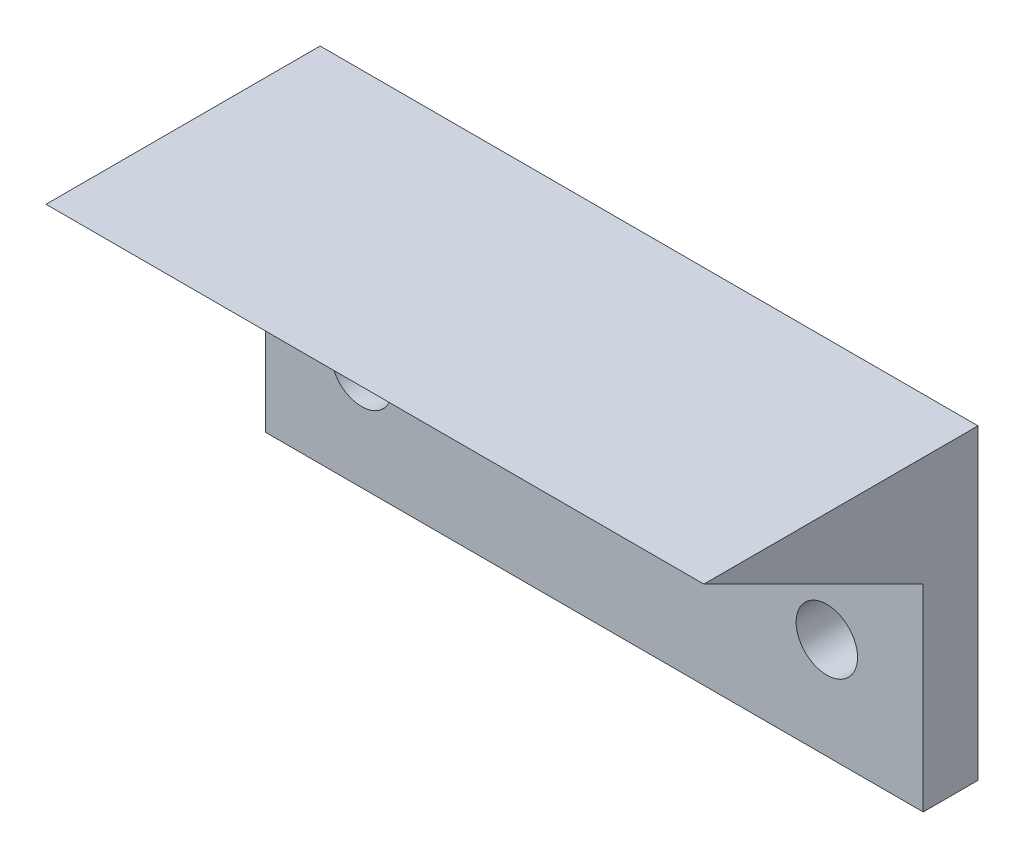
ISO-10303-21;
HEADER;
FILE_DESCRIPTION(('STEP AP214'),'2;1');
FILE_NAME('part.step','',(''),(''),'','','');
FILE_SCHEMA(('AUTOMOTIVE_DESIGN { 1 0 10303 214 1 1 1 1 }'));
ENDSEC;
DATA;
#1=APPLICATION_CONTEXT('core data for automotive mechanical design processes');
#2=APPLICATION_PROTOCOL_DEFINITION('international standard','automotive_design',2000,#1);
#3=PRODUCT_CONTEXT('',#1,'mechanical');
#4=PRODUCT('Part','Part','',(#3));
#5=PRODUCT_RELATED_PRODUCT_CATEGORY('part','',(#4));
#6=PRODUCT_DEFINITION_FORMATION('','',#4);
#7=PRODUCT_DEFINITION_CONTEXT('part definition',#1,'design');
#8=PRODUCT_DEFINITION('design','',#6,#7);
#9=PRODUCT_DEFINITION_SHAPE('','',#8);
#10=(LENGTH_UNIT() NAMED_UNIT(*) SI_UNIT(.MILLI.,.METRE.));
#11=(NAMED_UNIT(*) PLANE_ANGLE_UNIT() SI_UNIT($,.RADIAN.));
#12=(NAMED_UNIT(*) SI_UNIT($,.STERADIAN.) SOLID_ANGLE_UNIT());
#13=UNCERTAINTY_MEASURE_WITH_UNIT(LENGTH_MEASURE(1.E-05),#10,'distance_accuracy_value','');
#14=(GEOMETRIC_REPRESENTATION_CONTEXT(3) GLOBAL_UNCERTAINTY_ASSIGNED_CONTEXT((#13)) GLOBAL_UNIT_ASSIGNED_CONTEXT((#10,
#11,#12)) REPRESENTATION_CONTEXT('',''));
#15=CARTESIAN_POINT('',(0.,0.,0.));
#16=DIRECTION('',(0.,0.,1.));
#17=DIRECTION('',(1.,0.,0.));
#18=AXIS2_PLACEMENT_3D('',#15,#16,#17);
#19=CARTESIAN_POINT('',(0.,0.,3.175));
#20=DIRECTION('',(0.,0.,1.));
#21=DIRECTION('',(1.,0.,0.));
#22=AXIS2_PLACEMENT_3D('',#19,#20,#21);
#23=PLANE('',#22);
#24=DIRECTION('',(1.,0.,0.));
#25=VECTOR('',#24,1.);
#26=CARTESIAN_POINT('',(-14.1990316571237,-6.35,3.175));
#27=LINE('',#26,#25);
#28=CARTESIAN_POINT('',(0.,-6.35,3.175));
#29=VERTEX_POINT('',#28);
#30=CARTESIAN_POINT('',(38.1,-6.35,3.175));
#31=VERTEX_POINT('',#30);
#32=EDGE_CURVE('E48',#29,#31,#27,.T.);
#33=ORIENTED_EDGE('',*,*,#32,.F.);
#34=DIRECTION('',(0.,-1.,0.));
#35=VECTOR('',#34,1.);
#36=CARTESIAN_POINT('',(0.,0.,3.175));
#37=LINE('',#36,#35);
#38=CARTESIAN_POINT('',(0.,-17.78,3.175));
#39=VERTEX_POINT('',#38);
#40=EDGE_CURVE('E85',#29,#39,#37,.T.);
#41=ORIENTED_EDGE('',*,*,#40,.T.);
#42=DIRECTION('',(1.,0.,0.));
#43=VECTOR('',#42,1.);
#44=CARTESIAN_POINT('',(0.,-17.78,3.175));
#45=LINE('',#44,#43);
#46=CARTESIAN_POINT('',(38.1,-17.78,3.175));
#47=VERTEX_POINT('',#46);
#48=EDGE_CURVE('E54',#39,#47,#45,.T.);
#49=ORIENTED_EDGE('',*,*,#48,.T.);
#50=DIRECTION('',(0.,1.,0.));
#51=VECTOR('',#50,1.);
#52=CARTESIAN_POINT('',(38.1,0.,3.175));
#53=LINE('',#52,#51);
#54=EDGE_CURVE('E95',#47,#31,#53,.T.);
#55=ORIENTED_EDGE('',*,*,#54,.T.);
#56=EDGE_LOOP('',(#33,#41,#49,#55));
#57=FACE_BOUND('',#56,.T.);
#58=CARTESIAN_POINT('',(5.579618,-11.929615714,3.175));
#59=DIRECTION('',(0.,0.,1.));
#60=DIRECTION('',(1.,0.,0.));
#61=AXIS2_PLACEMENT_3D('',#58,#59,#60);
#62=CIRCLE('',#61,1.778);
#63=CARTESIAN_POINT('',(7.357618,-11.929615714,3.175));
#64=VERTEX_POINT('',#63);
#65=EDGE_CURVE('E100',#64,#64,#62,.T.);
#66=ORIENTED_EDGE('',*,*,#65,.F.);
#67=EDGE_LOOP('',(#66));
#68=FACE_BOUND('',#67,.T.);
#69=CARTESIAN_POINT('',(32.520382,-11.929615714,3.175));
#70=DIRECTION('',(0.,0.,1.));
#71=DIRECTION('',(1.,0.,0.));
#72=AXIS2_PLACEMENT_3D('',#69,#70,#71);
#73=CIRCLE('',#72,1.778);
#74=CARTESIAN_POINT('',(34.298382,-11.929615714,3.175));
#75=VERTEX_POINT('',#74);
#76=EDGE_CURVE('E126',#75,#75,#73,.T.);
#77=ORIENTED_EDGE('',*,*,#76,.F.);
#78=EDGE_LOOP('',(#77));
#79=FACE_BOUND('',#78,.T.);
#80=ADVANCED_FACE('F33',(#57,#68,#79),#23,.T.);
#81=CARTESIAN_POINT('',(0.,0.,0.));
#82=DIRECTION('',(0.,0.,1.));
#83=DIRECTION('',(1.,0.,0.));
#84=AXIS2_PLACEMENT_3D('',#81,#82,#83);
#85=PLANE('',#84);
#86=DIRECTION('',(0.,-1.,0.));
#87=VECTOR('',#86,1.);
#88=CARTESIAN_POINT('',(0.,0.,0.));
#89=LINE('',#88,#87);
#90=CARTESIAN_POINT('',(0.,0.,0.));
#91=VERTEX_POINT('',#90);
#92=CARTESIAN_POINT('',(0.,-17.78,0.));
#93=VERTEX_POINT('',#92);
#94=EDGE_CURVE('E91',#91,#93,#89,.T.);
#95=ORIENTED_EDGE('',*,*,#94,.F.);
#96=DIRECTION('',(-1.,0.,0.));
#97=VECTOR('',#96,1.);
#98=CARTESIAN_POINT('',(0.,0.,0.));
#99=LINE('',#98,#97);
#100=CARTESIAN_POINT('',(38.1,0.,0.));
#101=VERTEX_POINT('',#100);
#102=EDGE_CURVE('E74',#101,#91,#99,.T.);
#103=ORIENTED_EDGE('',*,*,#102,.F.);
#104=DIRECTION('',(0.,1.,0.));
#105=VECTOR('',#104,1.);
#106=CARTESIAN_POINT('',(38.1,0.,0.));
#107=LINE('',#106,#105);
#108=CARTESIAN_POINT('',(38.1,-17.78,0.));
#109=VERTEX_POINT('',#108);
#110=EDGE_CURVE('E86',#109,#101,#107,.T.);
#111=ORIENTED_EDGE('',*,*,#110,.F.);
#112=DIRECTION('',(1.,0.,0.));
#113=VECTOR('',#112,1.);
#114=CARTESIAN_POINT('',(0.,-17.78,0.));
#115=LINE('',#114,#113);
#116=EDGE_CURVE('E99',#93,#109,#115,.T.);
#117=ORIENTED_EDGE('',*,*,#116,.F.);
#118=EDGE_LOOP('',(#95,#103,#111,#117));
#119=FACE_BOUND('',#118,.T.);
#120=CARTESIAN_POINT('',(5.579618,-11.929615714,0.));
#121=DIRECTION('',(0.,0.,1.));
#122=DIRECTION('',(1.,0.,0.));
#123=AXIS2_PLACEMENT_3D('',#120,#121,#122);
#124=CIRCLE('',#123,1.778);
#125=CARTESIAN_POINT('',(7.357618,-11.929615714,0.));
#126=VERTEX_POINT('',#125);
#127=EDGE_CURVE('E104',#126,#126,#124,.T.);
#128=ORIENTED_EDGE('',*,*,#127,.T.);
#129=EDGE_LOOP('',(#128));
#130=FACE_BOUND('',#129,.T.);
#131=CARTESIAN_POINT('',(32.520382,-11.929615714,0.));
#132=DIRECTION('',(0.,0.,1.));
#133=DIRECTION('',(1.,0.,0.));
#134=AXIS2_PLACEMENT_3D('',#131,#132,#133);
#135=CIRCLE('',#134,1.778);
#136=CARTESIAN_POINT('',(34.298382,-11.929615714,0.));
#137=VERTEX_POINT('',#136);
#138=EDGE_CURVE('E123',#137,#137,#135,.T.);
#139=ORIENTED_EDGE('',*,*,#138,.T.);
#140=EDGE_LOOP('',(#139));
#141=FACE_BOUND('',#140,.T.);
#142=ADVANCED_FACE('F97',(#119,#130,#141),#85,.F.);
#143=CARTESIAN_POINT('',(0.,0.,3.175));
#144=DIRECTION('',(1.,0.,0.));
#145=DIRECTION('',(0.,0.,-1.));
#146=AXIS2_PLACEMENT_3D('',#143,#144,#145);
#147=PLANE('',#146);
#148=ORIENTED_EDGE('',*,*,#94,.T.);
#149=DIRECTION('',(0.,0.,-1.));
#150=VECTOR('',#149,1.);
#151=CARTESIAN_POINT('',(0.,-17.78,3.175));
#152=LINE('',#151,#150);
#153=EDGE_CURVE('E11',#39,#93,#152,.T.);
#154=ORIENTED_EDGE('',*,*,#153,.F.);
#155=ORIENTED_EDGE('',*,*,#40,.F.);
#156=DIRECTION('',(0.,0.447213595499958,0.894427190999916));
#157=VECTOR('',#156,1.);
#158=CARTESIAN_POINT('',(0.,-6.35,3.175));
#159=LINE('',#158,#157);
#160=CARTESIAN_POINT('',(0.,0.,15.875));
#161=VERTEX_POINT('',#160);
#162=EDGE_CURVE('E93',#29,#161,#159,.T.);
#163=ORIENTED_EDGE('',*,*,#162,.T.);
#164=DIRECTION('',(0.,0.,-1.));
#165=VECTOR('',#164,1.);
#166=CARTESIAN_POINT('',(0.,0.,3.175));
#167=LINE('',#166,#165);
#168=EDGE_CURVE('E78',#161,#91,#167,.T.);
#169=ORIENTED_EDGE('',*,*,#168,.T.);
#170=EDGE_LOOP('',(#148,#154,#155,#163,#169));
#171=FACE_BOUND('',#170,.T.);
#172=ADVANCED_FACE('F35',(#171),#147,.F.);
#173=CARTESIAN_POINT('',(0.,-17.78,3.175));
#174=DIRECTION('',(0.,1.,0.));
#175=DIRECTION('',(0.,0.,1.));
#176=AXIS2_PLACEMENT_3D('',#173,#174,#175);
#177=PLANE('',#176);
#178=ORIENTED_EDGE('',*,*,#116,.T.);
#179=DIRECTION('',(0.,0.,-1.));
#180=VECTOR('',#179,1.);
#181=CARTESIAN_POINT('',(38.1,-17.78,3.175));
#182=LINE('',#181,#180);
#183=EDGE_CURVE('E41',#47,#109,#182,.T.);
#184=ORIENTED_EDGE('',*,*,#183,.F.);
#185=ORIENTED_EDGE('',*,*,#48,.F.);
#186=ORIENTED_EDGE('',*,*,#153,.T.);
#187=EDGE_LOOP('',(#178,#184,#185,#186));
#188=FACE_BOUND('',#187,.T.);
#189=ADVANCED_FACE('F116',(#188),#177,.F.);
#190=CARTESIAN_POINT('',(38.1,0.,3.175));
#191=DIRECTION('',(-1.,0.,0.));
#192=DIRECTION('',(0.,0.,1.));
#193=AXIS2_PLACEMENT_3D('',#190,#191,#192);
#194=PLANE('',#193);
#195=ORIENTED_EDGE('',*,*,#110,.T.);
#196=DIRECTION('',(0.,0.,-1.));
#197=VECTOR('',#196,1.);
#198=CARTESIAN_POINT('',(38.1,0.,3.175));
#199=LINE('',#198,#197);
#200=CARTESIAN_POINT('',(38.1,0.,15.875));
#201=VERTEX_POINT('',#200);
#202=EDGE_CURVE('E81',#201,#101,#199,.T.);
#203=ORIENTED_EDGE('',*,*,#202,.F.);
#204=DIRECTION('',(0.,-0.447213595499958,-0.894427190999916));
#205=VECTOR('',#204,1.);
#206=CARTESIAN_POINT('',(38.1,-6.35,3.175));
#207=LINE('',#206,#205);
#208=EDGE_CURVE('E130',#201,#31,#207,.T.);
#209=ORIENTED_EDGE('',*,*,#208,.T.);
#210=ORIENTED_EDGE('',*,*,#54,.F.);
#211=ORIENTED_EDGE('',*,*,#183,.T.);
#212=EDGE_LOOP('',(#195,#203,#209,#210,#211));
#213=FACE_BOUND('',#212,.T.);
#214=ADVANCED_FACE('F113',(#213),#194,.F.);
#215=CARTESIAN_POINT('',(0.,0.,3.175));
#216=DIRECTION('',(0.,-1.,0.));
#217=DIRECTION('',(0.,0.,-1.));
#218=AXIS2_PLACEMENT_3D('',#215,#216,#217);
#219=PLANE('',#218);
#220=ORIENTED_EDGE('',*,*,#102,.T.);
#221=ORIENTED_EDGE('',*,*,#168,.F.);
#222=DIRECTION('',(1.,0.,0.));
#223=VECTOR('',#222,1.);
#224=CARTESIAN_POINT('',(-14.1990316571237,0.,15.875));
#225=LINE('',#224,#223);
#226=EDGE_CURVE('E122',#161,#201,#225,.T.);
#227=ORIENTED_EDGE('',*,*,#226,.T.);
#228=ORIENTED_EDGE('',*,*,#202,.T.);
#229=EDGE_LOOP('',(#220,#221,#227,#228));
#230=FACE_BOUND('',#229,.T.);
#231=ADVANCED_FACE('F76',(#230),#219,.F.);
#232=CARTESIAN_POINT('',(5.579618,-11.929615714,3.175));
#233=DIRECTION('',(0.,0.,-1.));
#234=DIRECTION('',(-1.,0.,0.));
#235=AXIS2_PLACEMENT_3D('',#232,#233,#234);
#236=CYLINDRICAL_SURFACE('',#235,1.778);
#237=ORIENTED_EDGE('',*,*,#65,.T.);
#238=EDGE_LOOP('',(#237));
#239=FACE_BOUND('',#238,.T.);
#240=ORIENTED_EDGE('',*,*,#127,.F.);
#241=EDGE_LOOP('',(#240));
#242=FACE_BOUND('',#241,.T.);
#243=ADVANCED_FACE('F149',(#239,#242),#236,.F.);
#244=CARTESIAN_POINT('',(32.520382,-11.929615714,3.175));
#245=DIRECTION('',(0.,0.,-1.));
#246=DIRECTION('',(-1.,0.,0.));
#247=AXIS2_PLACEMENT_3D('',#244,#245,#246);
#248=CYLINDRICAL_SURFACE('',#247,1.778);
#249=ORIENTED_EDGE('',*,*,#76,.T.);
#250=EDGE_LOOP('',(#249));
#251=FACE_BOUND('',#250,.T.);
#252=ORIENTED_EDGE('',*,*,#138,.F.);
#253=EDGE_LOOP('',(#252));
#254=FACE_BOUND('',#253,.T.);
#255=ADVANCED_FACE('F146',(#251,#254),#248,.F.);
#256=CARTESIAN_POINT('',(-14.1990316571237,-6.35,3.175));
#257=DIRECTION('',(0.,-0.894427190999916,0.447213595499958));
#258=DIRECTION('',(0.,-0.447213595499958,-0.894427190999916));
#259=AXIS2_PLACEMENT_3D('',#256,#257,#258);
#260=PLANE('',#259);
#261=ORIENTED_EDGE('',*,*,#162,.F.);
#262=ORIENTED_EDGE('',*,*,#32,.T.);
#263=ORIENTED_EDGE('',*,*,#208,.F.);
#264=ORIENTED_EDGE('',*,*,#226,.F.);
#265=EDGE_LOOP('',(#261,#262,#263,#264));
#266=FACE_BOUND('',#265,.T.);
#267=ADVANCED_FACE('F119',(#266),#260,.T.);
#268=CLOSED_SHELL('',(#80,#142,#172,#189,#214,#231,#243,#255,#267));
#269=MANIFOLD_SOLID_BREP('B2',#268);
#270=ADVANCED_BREP_SHAPE_REPRESENTATION('',(#18,#269),#14);
#271=SHAPE_DEFINITION_REPRESENTATION(#9,#270);
ENDSEC;
END-ISO-10303-21;
